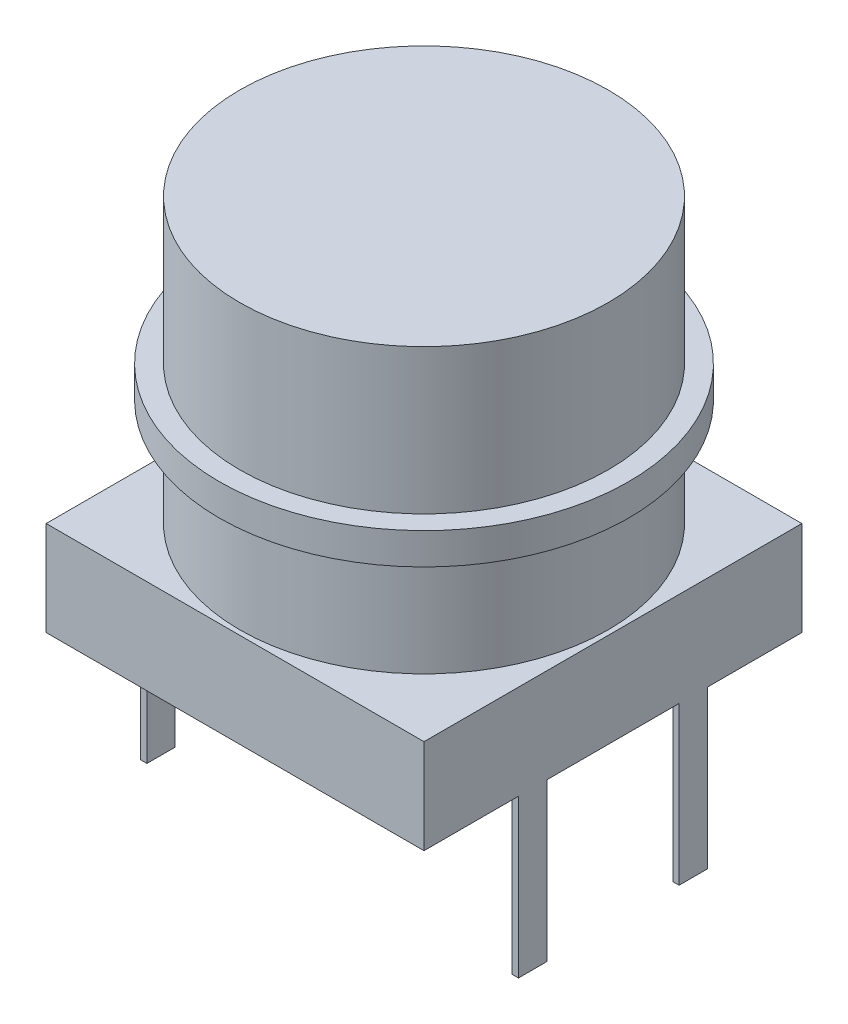
ISO-10303-21;
HEADER;
FILE_DESCRIPTION(('STEP AP214'),'2;1');
FILE_NAME('part.step','',(''),(''),'','','');
FILE_SCHEMA(('AUTOMOTIVE_DESIGN { 1 0 10303 214 1 1 1 1 }'));
ENDSEC;
DATA;
#1=APPLICATION_CONTEXT('core data for automotive mechanical design processes');
#2=APPLICATION_PROTOCOL_DEFINITION('international standard','automotive_design',2000,#1);
#3=PRODUCT_CONTEXT('',#1,'mechanical');
#4=PRODUCT('Part','Part','',(#3));
#5=PRODUCT_RELATED_PRODUCT_CATEGORY('part','',(#4));
#6=PRODUCT_DEFINITION_FORMATION('','',#4);
#7=PRODUCT_DEFINITION_CONTEXT('part definition',#1,'design');
#8=PRODUCT_DEFINITION('design','',#6,#7);
#9=PRODUCT_DEFINITION_SHAPE('','',#8);
#10=(LENGTH_UNIT() NAMED_UNIT(*) SI_UNIT(.MILLI.,.METRE.));
#11=(NAMED_UNIT(*) PLANE_ANGLE_UNIT() SI_UNIT($,.RADIAN.));
#12=(NAMED_UNIT(*) SI_UNIT($,.STERADIAN.) SOLID_ANGLE_UNIT());
#13=UNCERTAINTY_MEASURE_WITH_UNIT(LENGTH_MEASURE(1.E-05),#10,'distance_accuracy_value','');
#14=(GEOMETRIC_REPRESENTATION_CONTEXT(3) GLOBAL_UNCERTAINTY_ASSIGNED_CONTEXT((#13)) GLOBAL_UNIT_ASSIGNED_CONTEXT((#10,
#11,#12)) REPRESENTATION_CONTEXT('',''));
#15=CARTESIAN_POINT('',(0.,0.,0.));
#16=DIRECTION('',(0.,0.,1.));
#17=DIRECTION('',(1.,0.,0.));
#18=AXIS2_PLACEMENT_3D('',#15,#16,#17);
#19=CARTESIAN_POINT('',(0.,0.,0.));
#20=DIRECTION('',(0.,1.,0.));
#21=DIRECTION('',(0.,0.,1.));
#22=AXIS2_PLACEMENT_3D('',#19,#20,#21);
#23=PLANE('',#22);
#24=DIRECTION('',(-1.,0.,0.));
#25=VECTOR('',#24,1.);
#26=CARTESIAN_POINT('',(-5.8,0.,3.));
#27=LINE('',#26,#25);
#28=CARTESIAN_POINT('',(-5.8,0.,3.));
#29=VERTEX_POINT('',#28);
#30=CARTESIAN_POINT('',(-6.,0.,3.));
#31=VERTEX_POINT('',#30);
#32=EDGE_CURVE('E50',#29,#31,#27,.T.);
#33=ORIENTED_EDGE('',*,*,#32,.F.);
#34=DIRECTION('',(0.,0.,1.));
#35=VECTOR('',#34,1.);
#36=CARTESIAN_POINT('',(-5.8,0.,3.));
#37=LINE('',#36,#35);
#38=CARTESIAN_POINT('',(-5.8,0.,2.1));
#39=VERTEX_POINT('',#38);
#40=EDGE_CURVE('E193',#39,#29,#37,.T.);
#41=ORIENTED_EDGE('',*,*,#40,.F.);
#42=DIRECTION('',(1.,0.,0.));
#43=VECTOR('',#42,1.);
#44=CARTESIAN_POINT('',(-5.8,0.,2.1));
#45=LINE('',#44,#43);
#46=CARTESIAN_POINT('',(-6.,0.,2.1));
#47=VERTEX_POINT('',#46);
#48=EDGE_CURVE('E595',#47,#39,#45,.T.);
#49=ORIENTED_EDGE('',*,*,#48,.F.);
#50=DIRECTION('',(0.,0.,1.));
#51=VECTOR('',#50,1.);
#52=CARTESIAN_POINT('',(-6.,0.,-6.));
#53=LINE('',#52,#51);
#54=CARTESIAN_POINT('',(-6.,0.,-2.1));
#55=VERTEX_POINT('',#54);
#56=EDGE_CURVE('E313',#55,#47,#53,.T.);
#57=ORIENTED_EDGE('',*,*,#56,.F.);
#58=DIRECTION('',(-1.,0.,0.));
#59=VECTOR('',#58,1.);
#60=CARTESIAN_POINT('',(-5.8,0.,-2.1));
#61=LINE('',#60,#59);
#62=CARTESIAN_POINT('',(-5.8,0.,-2.1));
#63=VERTEX_POINT('',#62);
#64=EDGE_CURVE('E238',#63,#55,#61,.T.);
#65=ORIENTED_EDGE('',*,*,#64,.F.);
#66=DIRECTION('',(0.,0.,1.));
#67=VECTOR('',#66,1.);
#68=CARTESIAN_POINT('',(-5.8,0.,-3.));
#69=LINE('',#68,#67);
#70=CARTESIAN_POINT('',(-5.8,0.,-3.));
#71=VERTEX_POINT('',#70);
#72=EDGE_CURVE('E224',#71,#63,#69,.T.);
#73=ORIENTED_EDGE('',*,*,#72,.F.);
#74=DIRECTION('',(1.,0.,0.));
#75=VECTOR('',#74,1.);
#76=CARTESIAN_POINT('',(-5.8,0.,-3.));
#77=LINE('',#76,#75);
#78=CARTESIAN_POINT('',(-6.,0.,-3.));
#79=VERTEX_POINT('',#78);
#80=EDGE_CURVE('E229',#79,#71,#77,.T.);
#81=ORIENTED_EDGE('',*,*,#80,.F.);
#82=CARTESIAN_POINT('',(-6.,0.,-6.));
#83=VERTEX_POINT('',#82);
#84=EDGE_CURVE('E311',#83,#79,#53,.T.);
#85=ORIENTED_EDGE('',*,*,#84,.F.);
#86=DIRECTION('',(-1.,0.,0.));
#87=VECTOR('',#86,1.);
#88=CARTESIAN_POINT('',(-6.,0.,-6.));
#89=LINE('',#88,#87);
#90=CARTESIAN_POINT('',(6.,0.,-6.));
#91=VERTEX_POINT('',#90);
#92=EDGE_CURVE('E307',#91,#83,#89,.T.);
#93=ORIENTED_EDGE('',*,*,#92,.F.);
#94=DIRECTION('',(0.,0.,-1.));
#95=VECTOR('',#94,1.);
#96=CARTESIAN_POINT('',(6.,0.,-6.));
#97=LINE('',#96,#95);
#98=CARTESIAN_POINT('',(6.,0.,-3.));
#99=VERTEX_POINT('',#98);
#100=EDGE_CURVE('E290',#99,#91,#97,.T.);
#101=ORIENTED_EDGE('',*,*,#100,.F.);
#102=DIRECTION('',(1.,0.,0.));
#103=VECTOR('',#102,1.);
#104=CARTESIAN_POINT('',(5.8,0.,-3.));
#105=LINE('',#104,#103);
#106=CARTESIAN_POINT('',(5.8,0.,-3.));
#107=VERTEX_POINT('',#106);
#108=EDGE_CURVE('E58',#107,#99,#105,.T.);
#109=ORIENTED_EDGE('',*,*,#108,.F.);
#110=DIRECTION('',(0.,0.,-1.));
#111=VECTOR('',#110,1.);
#112=CARTESIAN_POINT('',(5.8,0.,-3.));
#113=LINE('',#112,#111);
#114=CARTESIAN_POINT('',(5.8,0.,-2.1));
#115=VERTEX_POINT('',#114);
#116=EDGE_CURVE('E207',#115,#107,#113,.T.);
#117=ORIENTED_EDGE('',*,*,#116,.F.);
#118=DIRECTION('',(-1.,0.,0.));
#119=VECTOR('',#118,1.);
#120=CARTESIAN_POINT('',(5.8,0.,-2.1));
#121=LINE('',#120,#119);
#122=CARTESIAN_POINT('',(6.,0.,-2.1));
#123=VERTEX_POINT('',#122);
#124=EDGE_CURVE('E197',#123,#115,#121,.T.);
#125=ORIENTED_EDGE('',*,*,#124,.F.);
#126=CARTESIAN_POINT('',(6.,0.,2.1));
#127=VERTEX_POINT('',#126);
#128=EDGE_CURVE('E308',#127,#123,#97,.T.);
#129=ORIENTED_EDGE('',*,*,#128,.F.);
#130=DIRECTION('',(1.,0.,0.));
#131=VECTOR('',#130,1.);
#132=CARTESIAN_POINT('',(5.8,0.,2.1));
#133=LINE('',#132,#131);
#134=CARTESIAN_POINT('',(5.8,0.,2.1));
#135=VERTEX_POINT('',#134);
#136=EDGE_CURVE('E264',#135,#127,#133,.T.);
#137=ORIENTED_EDGE('',*,*,#136,.F.);
#138=DIRECTION('',(0.,0.,-1.));
#139=VECTOR('',#138,1.);
#140=CARTESIAN_POINT('',(5.8,0.,3.));
#141=LINE('',#140,#139);
#142=CARTESIAN_POINT('',(5.8,0.,3.));
#143=VERTEX_POINT('',#142);
#144=EDGE_CURVE('E250',#143,#135,#141,.T.);
#145=ORIENTED_EDGE('',*,*,#144,.F.);
#146=DIRECTION('',(-1.,0.,0.));
#147=VECTOR('',#146,1.);
#148=CARTESIAN_POINT('',(5.8,0.,3.));
#149=LINE('',#148,#147);
#150=CARTESIAN_POINT('',(6.,0.,3.));
#151=VERTEX_POINT('',#150);
#152=EDGE_CURVE('E255',#151,#143,#149,.T.);
#153=ORIENTED_EDGE('',*,*,#152,.F.);
#154=CARTESIAN_POINT('',(6.,0.,6.));
#155=VERTEX_POINT('',#154);
#156=EDGE_CURVE('E304',#155,#151,#97,.T.);
#157=ORIENTED_EDGE('',*,*,#156,.F.);
#158=DIRECTION('',(1.,0.,0.));
#159=VECTOR('',#158,1.);
#160=CARTESIAN_POINT('',(-6.,0.,6.));
#161=LINE('',#160,#159);
#162=CARTESIAN_POINT('',(-6.,0.,6.));
#163=VERTEX_POINT('',#162);
#164=EDGE_CURVE('E297',#163,#155,#161,.T.);
#165=ORIENTED_EDGE('',*,*,#164,.F.);
#166=EDGE_CURVE('E310',#31,#163,#53,.T.);
#167=ORIENTED_EDGE('',*,*,#166,.F.);
#168=EDGE_LOOP('',(#33,#41,#49,#57,#65,#73,#81,#85,#93,#101,#109,#117,#125,#129,#137,#145,#153,
#157,#165,#167));
#169=FACE_BOUND('',#168,.T.);
#170=ADVANCED_FACE('F33',(#169),#23,.F.);
#171=CARTESIAN_POINT('',(6.,3.,-6.));
#172=DIRECTION('',(-1.,0.,0.));
#173=DIRECTION('',(0.,0.,1.));
#174=AXIS2_PLACEMENT_3D('',#171,#172,#173);
#175=PLANE('',#174);
#176=ORIENTED_EDGE('',*,*,#156,.T.);
#177=DIRECTION('',(0.,1.,0.));
#178=VECTOR('',#177,1.);
#179=CARTESIAN_POINT('',(6.,-5.,3.));
#180=LINE('',#179,#178);
#181=CARTESIAN_POINT('',(6.,-5.,3.));
#182=VERTEX_POINT('',#181);
#183=EDGE_CURVE('E271',#182,#151,#180,.T.);
#184=ORIENTED_EDGE('',*,*,#183,.F.);
#185=DIRECTION('',(0.,0.,1.));
#186=VECTOR('',#185,1.);
#187=CARTESIAN_POINT('',(6.,-5.,3.));
#188=LINE('',#187,#186);
#189=CARTESIAN_POINT('',(6.,-5.,2.1));
#190=VERTEX_POINT('',#189);
#191=EDGE_CURVE('E257',#190,#182,#188,.T.);
#192=ORIENTED_EDGE('',*,*,#191,.F.);
#193=DIRECTION('',(0.,1.,0.));
#194=VECTOR('',#193,1.);
#195=CARTESIAN_POINT('',(6.,-5.,2.1));
#196=LINE('',#195,#194);
#197=EDGE_CURVE('E274',#190,#127,#196,.T.);
#198=ORIENTED_EDGE('',*,*,#197,.T.);
#199=ORIENTED_EDGE('',*,*,#128,.T.);
#200=DIRECTION('',(0.,1.,0.));
#201=VECTOR('',#200,1.);
#202=CARTESIAN_POINT('',(6.,-5.,-2.1));
#203=LINE('',#202,#201);
#204=CARTESIAN_POINT('',(6.,-5.,-2.1));
#205=VERTEX_POINT('',#204);
#206=EDGE_CURVE('E220',#205,#123,#203,.T.);
#207=ORIENTED_EDGE('',*,*,#206,.F.);
#208=DIRECTION('',(0.,0.,1.));
#209=VECTOR('',#208,1.);
#210=CARTESIAN_POINT('',(6.,-5.,-3.));
#211=LINE('',#210,#209);
#212=CARTESIAN_POINT('',(6.,-5.,-3.));
#213=VERTEX_POINT('',#212);
#214=EDGE_CURVE('E206',#213,#205,#211,.T.);
#215=ORIENTED_EDGE('',*,*,#214,.F.);
#216=DIRECTION('',(0.,1.,0.));
#217=VECTOR('',#216,1.);
#218=CARTESIAN_POINT('',(6.,-5.,-3.));
#219=LINE('',#218,#217);
#220=EDGE_CURVE('E222',#213,#99,#219,.T.);
#221=ORIENTED_EDGE('',*,*,#220,.T.);
#222=ORIENTED_EDGE('',*,*,#100,.T.);
#223=DIRECTION('',(0.,-1.,0.));
#224=VECTOR('',#223,1.);
#225=CARTESIAN_POINT('',(6.,3.,-6.));
#226=LINE('',#225,#224);
#227=CARTESIAN_POINT('',(6.,3.,-6.));
#228=VERTEX_POINT('',#227);
#229=EDGE_CURVE('E42',#228,#91,#226,.T.);
#230=ORIENTED_EDGE('',*,*,#229,.F.);
#231=DIRECTION('',(0.,0.,-1.));
#232=VECTOR('',#231,1.);
#233=CARTESIAN_POINT('',(6.,3.,-6.));
#234=LINE('',#233,#232);
#235=CARTESIAN_POINT('',(6.,3.,6.));
#236=VERTEX_POINT('',#235);
#237=EDGE_CURVE('E293',#236,#228,#234,.T.);
#238=ORIENTED_EDGE('',*,*,#237,.F.);
#239=DIRECTION('',(0.,-1.,0.));
#240=VECTOR('',#239,1.);
#241=CARTESIAN_POINT('',(6.,3.,6.));
#242=LINE('',#241,#240);
#243=EDGE_CURVE('E303',#236,#155,#242,.T.);
#244=ORIENTED_EDGE('',*,*,#243,.T.);
#245=EDGE_LOOP('',(#176,#184,#192,#198,#199,#207,#215,#221,#222,#230,#238,#244));
#246=FACE_BOUND('',#245,.T.);
#247=ADVANCED_FACE('F35',(#246),#175,.F.);
#248=CARTESIAN_POINT('',(-6.,3.,-6.));
#249=DIRECTION('',(0.,0.,1.));
#250=DIRECTION('',(1.,0.,0.));
#251=AXIS2_PLACEMENT_3D('',#248,#249,#250);
#252=PLANE('',#251);
#253=ORIENTED_EDGE('',*,*,#92,.T.);
#254=DIRECTION('',(0.,-1.,0.));
#255=VECTOR('',#254,1.);
#256=CARTESIAN_POINT('',(-6.,3.,-6.));
#257=LINE('',#256,#255);
#258=CARTESIAN_POINT('',(-6.,3.,-6.));
#259=VERTEX_POINT('',#258);
#260=EDGE_CURVE('E320',#259,#83,#257,.T.);
#261=ORIENTED_EDGE('',*,*,#260,.F.);
#262=DIRECTION('',(-1.,0.,0.));
#263=VECTOR('',#262,1.);
#264=CARTESIAN_POINT('',(-6.,3.,-6.));
#265=LINE('',#264,#263);
#266=EDGE_CURVE('E296',#228,#259,#265,.T.);
#267=ORIENTED_EDGE('',*,*,#266,.F.);
#268=ORIENTED_EDGE('',*,*,#229,.T.);
#269=EDGE_LOOP('',(#253,#261,#267,#268));
#270=FACE_BOUND('',#269,.T.);
#271=ADVANCED_FACE('F325',(#270),#252,.F.);
#272=CARTESIAN_POINT('',(-6.,3.,-6.));
#273=DIRECTION('',(1.,0.,0.));
#274=DIRECTION('',(0.,0.,-1.));
#275=AXIS2_PLACEMENT_3D('',#272,#273,#274);
#276=PLANE('',#275);
#277=ORIENTED_EDGE('',*,*,#84,.T.);
#278=DIRECTION('',(0.,1.,0.));
#279=VECTOR('',#278,1.);
#280=CARTESIAN_POINT('',(-6.,-5.,-3.));
#281=LINE('',#280,#279);
#282=CARTESIAN_POINT('',(-6.,-5.,-3.));
#283=VERTEX_POINT('',#282);
#284=EDGE_CURVE('E244',#283,#79,#281,.T.);
#285=ORIENTED_EDGE('',*,*,#284,.F.);
#286=DIRECTION('',(0.,0.,-1.));
#287=VECTOR('',#286,1.);
#288=CARTESIAN_POINT('',(-6.,-5.,-3.));
#289=LINE('',#288,#287);
#290=CARTESIAN_POINT('',(-6.,-5.,-2.1));
#291=VERTEX_POINT('',#290);
#292=EDGE_CURVE('E231',#291,#283,#289,.T.);
#293=ORIENTED_EDGE('',*,*,#292,.F.);
#294=DIRECTION('',(0.,1.,0.));
#295=VECTOR('',#294,1.);
#296=CARTESIAN_POINT('',(-6.,-5.,-2.1));
#297=LINE('',#296,#295);
#298=EDGE_CURVE('E246',#291,#55,#297,.T.);
#299=ORIENTED_EDGE('',*,*,#298,.T.);
#300=ORIENTED_EDGE('',*,*,#56,.T.);
#301=DIRECTION('',(0.,1.,0.));
#302=VECTOR('',#301,1.);
#303=CARTESIAN_POINT('',(-6.,-5.,2.1));
#304=LINE('',#303,#302);
#305=CARTESIAN_POINT('',(-6.,-5.,2.1));
#306=VERTEX_POINT('',#305);
#307=EDGE_CURVE('E182',#306,#47,#304,.T.);
#308=ORIENTED_EDGE('',*,*,#307,.F.);
#309=DIRECTION('',(0.,0.,-1.));
#310=VECTOR('',#309,1.);
#311=CARTESIAN_POINT('',(-6.,-5.,3.));
#312=LINE('',#311,#310);
#313=CARTESIAN_POINT('',(-6.,-5.,3.));
#314=VERTEX_POINT('',#313);
#315=EDGE_CURVE('E175',#314,#306,#312,.T.);
#316=ORIENTED_EDGE('',*,*,#315,.F.);
#317=DIRECTION('',(0.,1.,0.));
#318=VECTOR('',#317,1.);
#319=CARTESIAN_POINT('',(-6.,-5.,3.));
#320=LINE('',#319,#318);
#321=EDGE_CURVE('E179',#314,#31,#320,.T.);
#322=ORIENTED_EDGE('',*,*,#321,.T.);
#323=ORIENTED_EDGE('',*,*,#166,.T.);
#324=DIRECTION('',(0.,-1.,0.));
#325=VECTOR('',#324,1.);
#326=CARTESIAN_POINT('',(-6.,3.,6.));
#327=LINE('',#326,#325);
#328=CARTESIAN_POINT('',(-6.,3.,6.));
#329=VERTEX_POINT('',#328);
#330=EDGE_CURVE('E317',#329,#163,#327,.T.);
#331=ORIENTED_EDGE('',*,*,#330,.F.);
#332=DIRECTION('',(0.,0.,1.));
#333=VECTOR('',#332,1.);
#334=CARTESIAN_POINT('',(-6.,3.,-6.));
#335=LINE('',#334,#333);
#336=EDGE_CURVE('E299',#259,#329,#335,.T.);
#337=ORIENTED_EDGE('',*,*,#336,.F.);
#338=ORIENTED_EDGE('',*,*,#260,.T.);
#339=EDGE_LOOP('',(#277,#285,#293,#299,#300,#308,#316,#322,#323,#331,#337,#338));
#340=FACE_BOUND('',#339,.T.);
#341=ADVANCED_FACE('F178',(#340),#276,.F.);
#342=CARTESIAN_POINT('',(-6.,3.,6.));
#343=DIRECTION('',(0.,0.,-1.));
#344=DIRECTION('',(-1.,0.,0.));
#345=AXIS2_PLACEMENT_3D('',#342,#343,#344);
#346=PLANE('',#345);
#347=ORIENTED_EDGE('',*,*,#164,.T.);
#348=ORIENTED_EDGE('',*,*,#243,.F.);
#349=DIRECTION('',(1.,0.,0.));
#350=VECTOR('',#349,1.);
#351=CARTESIAN_POINT('',(-6.,3.,6.));
#352=LINE('',#351,#350);
#353=EDGE_CURVE('E301',#329,#236,#352,.T.);
#354=ORIENTED_EDGE('',*,*,#353,.F.);
#355=ORIENTED_EDGE('',*,*,#330,.T.);
#356=EDGE_LOOP('',(#347,#348,#354,#355));
#357=FACE_BOUND('',#356,.T.);
#358=ADVANCED_FACE('F345',(#357),#346,.F.);
#359=CARTESIAN_POINT('',(0.,3.,0.));
#360=DIRECTION('',(0.,1.,0.));
#361=DIRECTION('',(0.,0.,1.));
#362=AXIS2_PLACEMENT_3D('',#359,#360,#361);
#363=PLANE('',#362);
#364=CARTESIAN_POINT('',(0.,3.,0.));
#365=DIRECTION('',(0.,1.,0.));
#366=DIRECTION('',(0.,0.,1.));
#367=AXIS2_PLACEMENT_3D('',#364,#365,#366);
#368=CIRCLE('',#367,5.85);
#369=CARTESIAN_POINT('',(0.,3.,5.85));
#370=VERTEX_POINT('',#369);
#371=EDGE_CURVE('E283',#370,#370,#368,.F.);
#372=ORIENTED_EDGE('',*,*,#371,.T.);
#373=EDGE_LOOP('',(#372));
#374=FACE_BOUND('',#373,.T.);
#375=ORIENTED_EDGE('',*,*,#237,.T.);
#376=ORIENTED_EDGE('',*,*,#266,.T.);
#377=ORIENTED_EDGE('',*,*,#336,.T.);
#378=ORIENTED_EDGE('',*,*,#353,.T.);
#379=EDGE_LOOP('',(#375,#376,#377,#378));
#380=FACE_BOUND('',#379,.T.);
#381=ADVANCED_FACE('F342',(#374,#380),#363,.T.);
#382=CARTESIAN_POINT('',(0.,12.,0.));
#383=DIRECTION('',(0.,-1.,0.));
#384=DIRECTION('',(0.,0.,-1.));
#385=AXIS2_PLACEMENT_3D('',#382,#383,#384);
#386=CYLINDRICAL_SURFACE('',#385,5.85);
#387=ORIENTED_EDGE('',*,*,#371,.F.);
#388=EDGE_LOOP('',(#387));
#389=FACE_BOUND('',#388,.T.);
#390=CARTESIAN_POINT('',(0.,6.4,0.));
#391=DIRECTION('',(0.,1.,0.));
#392=DIRECTION('',(0.,0.,1.));
#393=AXIS2_PLACEMENT_3D('',#390,#391,#392);
#394=CIRCLE('',#393,5.85);
#395=CARTESIAN_POINT('',(0.,6.4,5.85));
#396=VERTEX_POINT('',#395);
#397=EDGE_CURVE('E11',#396,#396,#394,.F.);
#398=ORIENTED_EDGE('',*,*,#397,.T.);
#399=EDGE_LOOP('',(#398));
#400=FACE_BOUND('',#399,.T.);
#401=ADVANCED_FACE('F417',(#389,#400),#386,.T.);
#402=CARTESIAN_POINT('',(0.,6.4,0.));
#403=DIRECTION('',(0.,1.,0.));
#404=DIRECTION('',(0.,0.,1.));
#405=AXIS2_PLACEMENT_3D('',#402,#403,#404);
#406=PLANE('',#405);
#407=ORIENTED_EDGE('',*,*,#397,.F.);
#408=EDGE_LOOP('',(#407));
#409=FACE_BOUND('',#408,.T.);
#410=CARTESIAN_POINT('',(0.,6.4,0.));
#411=DIRECTION('',(0.,1.,0.));
#412=DIRECTION('',(0.,0.,1.));
#413=AXIS2_PLACEMENT_3D('',#410,#411,#412);
#414=CIRCLE('',#413,6.5);
#415=CARTESIAN_POINT('',(0.,6.4,6.5));
#416=VERTEX_POINT('',#415);
#417=EDGE_CURVE('E286',#416,#416,#414,.T.);
#418=ORIENTED_EDGE('',*,*,#417,.F.);
#419=EDGE_LOOP('',(#418));
#420=FACE_BOUND('',#419,.T.);
#421=ADVANCED_FACE('F424',(#409,#420),#406,.F.);
#422=CARTESIAN_POINT('',(0.,7.4,0.));
#423=DIRECTION('',(0.,-1.,0.));
#424=DIRECTION('',(0.,0.,-1.));
#425=AXIS2_PLACEMENT_3D('',#422,#423,#424);
#426=CYLINDRICAL_SURFACE('',#425,6.5);
#427=CARTESIAN_POINT('',(0.,7.4,0.));
#428=DIRECTION('',(0.,1.,0.));
#429=DIRECTION('',(0.,0.,1.));
#430=AXIS2_PLACEMENT_3D('',#427,#428,#429);
#431=CIRCLE('',#430,6.5);
#432=CARTESIAN_POINT('',(0.,7.4,6.5));
#433=VERTEX_POINT('',#432);
#434=EDGE_CURVE('E287',#433,#433,#431,.T.);
#435=ORIENTED_EDGE('',*,*,#434,.F.);
#436=EDGE_LOOP('',(#435));
#437=FACE_BOUND('',#436,.T.);
#438=ORIENTED_EDGE('',*,*,#417,.T.);
#439=EDGE_LOOP('',(#438));
#440=FACE_BOUND('',#439,.T.);
#441=ADVANCED_FACE('F433',(#437,#440),#426,.T.);
#442=CARTESIAN_POINT('',(0.,7.4,0.));
#443=DIRECTION('',(0.,1.,0.));
#444=DIRECTION('',(0.,0.,1.));
#445=AXIS2_PLACEMENT_3D('',#442,#443,#444);
#446=PLANE('',#445);
#447=CARTESIAN_POINT('',(0.,7.4,0.));
#448=DIRECTION('',(0.,1.,0.));
#449=DIRECTION('',(0.,0.,1.));
#450=AXIS2_PLACEMENT_3D('',#447,#448,#449);
#451=CIRCLE('',#450,5.85);
#452=CARTESIAN_POINT('',(0.,7.4,5.85));
#453=VERTEX_POINT('',#452);
#454=EDGE_CURVE('E37',#453,#453,#451,.F.);
#455=ORIENTED_EDGE('',*,*,#454,.T.);
#456=EDGE_LOOP('',(#455));
#457=FACE_BOUND('',#456,.T.);
#458=ORIENTED_EDGE('',*,*,#434,.T.);
#459=EDGE_LOOP('',(#458));
#460=FACE_BOUND('',#459,.T.);
#461=ADVANCED_FACE('F441',(#457,#460),#446,.T.);
#462=CARTESIAN_POINT('',(0.,12.,0.));
#463=DIRECTION('',(0.,1.,0.));
#464=DIRECTION('',(0.,0.,1.));
#465=AXIS2_PLACEMENT_3D('',#462,#463,#464);
#466=PLANE('',#465);
#467=CARTESIAN_POINT('',(0.,12.,0.));
#468=DIRECTION('',(0.,1.,0.));
#469=DIRECTION('',(0.,0.,1.));
#470=AXIS2_PLACEMENT_3D('',#467,#468,#469);
#471=CIRCLE('',#470,5.85);
#472=CARTESIAN_POINT('',(0.,12.,5.85));
#473=VERTEX_POINT('',#472);
#474=EDGE_CURVE('E280',#473,#473,#471,.T.);
#475=ORIENTED_EDGE('',*,*,#474,.T.);
#476=EDGE_LOOP('',(#475));
#477=FACE_BOUND('',#476,.T.);
#478=ADVANCED_FACE('F447',(#477),#466,.T.);
#479=ORIENTED_EDGE('',*,*,#454,.F.);
#480=EDGE_LOOP('',(#479));
#481=FACE_BOUND('',#480,.T.);
#482=ORIENTED_EDGE('',*,*,#474,.F.);
#483=EDGE_LOOP('',(#482));
#484=FACE_BOUND('',#483,.T.);
#485=ADVANCED_FACE('F427',(#481,#484),#386,.T.);
#486=CARTESIAN_POINT('',(5.8,-5.,3.));
#487=DIRECTION('',(1.,0.,0.));
#488=DIRECTION('',(0.,0.,-1.));
#489=AXIS2_PLACEMENT_3D('',#486,#487,#488);
#490=PLANE('',#489);
#491=ORIENTED_EDGE('',*,*,#144,.T.);
#492=DIRECTION('',(0.,1.,0.));
#493=VECTOR('',#492,1.);
#494=CARTESIAN_POINT('',(5.8,-5.,2.1));
#495=LINE('',#494,#493);
#496=CARTESIAN_POINT('',(5.8,-5.,2.1));
#497=VERTEX_POINT('',#496);
#498=EDGE_CURVE('E277',#497,#135,#495,.T.);
#499=ORIENTED_EDGE('',*,*,#498,.F.);
#500=DIRECTION('',(0.,0.,-1.));
#501=VECTOR('',#500,1.);
#502=CARTESIAN_POINT('',(5.8,-5.,3.));
#503=LINE('',#502,#501);
#504=CARTESIAN_POINT('',(5.8,-5.,3.));
#505=VERTEX_POINT('',#504);
#506=EDGE_CURVE('E251',#505,#497,#503,.T.);
#507=ORIENTED_EDGE('',*,*,#506,.F.);
#508=DIRECTION('',(0.,1.,0.));
#509=VECTOR('',#508,1.);
#510=CARTESIAN_POINT('',(5.8,-5.,3.));
#511=LINE('',#510,#509);
#512=EDGE_CURVE('E261',#505,#143,#511,.T.);
#513=ORIENTED_EDGE('',*,*,#512,.T.);
#514=EDGE_LOOP('',(#491,#499,#507,#513));
#515=FACE_BOUND('',#514,.T.);
#516=ADVANCED_FACE('F355',(#515),#490,.F.);
#517=CARTESIAN_POINT('',(5.8,-5.,2.1));
#518=DIRECTION('',(0.,0.,1.));
#519=DIRECTION('',(1.,0.,0.));
#520=AXIS2_PLACEMENT_3D('',#517,#518,#519);
#521=PLANE('',#520);
#522=ORIENTED_EDGE('',*,*,#136,.T.);
#523=ORIENTED_EDGE('',*,*,#197,.F.);
#524=DIRECTION('',(1.,0.,0.));
#525=VECTOR('',#524,1.);
#526=CARTESIAN_POINT('',(5.8,-5.,2.1));
#527=LINE('',#526,#525);
#528=EDGE_CURVE('E254',#497,#190,#527,.T.);
#529=ORIENTED_EDGE('',*,*,#528,.F.);
#530=ORIENTED_EDGE('',*,*,#498,.T.);
#531=EDGE_LOOP('',(#522,#523,#529,#530));
#532=FACE_BOUND('',#531,.T.);
#533=ADVANCED_FACE('F364',(#532),#521,.F.);
#534=CARTESIAN_POINT('',(5.8,-5.,3.));
#535=DIRECTION('',(0.,0.,-1.));
#536=DIRECTION('',(-1.,0.,0.));
#537=AXIS2_PLACEMENT_3D('',#534,#535,#536);
#538=PLANE('',#537);
#539=ORIENTED_EDGE('',*,*,#152,.T.);
#540=ORIENTED_EDGE('',*,*,#512,.F.);
#541=DIRECTION('',(-1.,0.,0.));
#542=VECTOR('',#541,1.);
#543=CARTESIAN_POINT('',(5.8,-5.,3.));
#544=LINE('',#543,#542);
#545=EDGE_CURVE('E259',#182,#505,#544,.T.);
#546=ORIENTED_EDGE('',*,*,#545,.F.);
#547=ORIENTED_EDGE('',*,*,#183,.T.);
#548=EDGE_LOOP('',(#539,#540,#546,#547));
#549=FACE_BOUND('',#548,.T.);
#550=ADVANCED_FACE('F351',(#549),#538,.F.);
#551=CARTESIAN_POINT('',(0.,-5.,0.));
#552=DIRECTION('',(0.,-1.,0.));
#553=DIRECTION('',(0.,0.,-1.));
#554=AXIS2_PLACEMENT_3D('',#551,#552,#553);
#555=PLANE('',#554);
#556=ORIENTED_EDGE('',*,*,#506,.T.);
#557=ORIENTED_EDGE('',*,*,#528,.T.);
#558=ORIENTED_EDGE('',*,*,#191,.T.);
#559=ORIENTED_EDGE('',*,*,#545,.T.);
#560=EDGE_LOOP('',(#556,#557,#558,#559));
#561=FACE_BOUND('',#560,.T.);
#562=ADVANCED_FACE('F358',(#561),#555,.T.);
#563=CARTESIAN_POINT('',(-5.8,-5.,-3.));
#564=DIRECTION('',(-1.,0.,0.));
#565=DIRECTION('',(0.,0.,1.));
#566=AXIS2_PLACEMENT_3D('',#563,#564,#565);
#567=PLANE('',#566);
#568=ORIENTED_EDGE('',*,*,#72,.T.);
#569=DIRECTION('',(0.,1.,0.));
#570=VECTOR('',#569,1.);
#571=CARTESIAN_POINT('',(-5.8,-5.,-2.1));
#572=LINE('',#571,#570);
#573=CARTESIAN_POINT('',(-5.8,-5.,-2.1));
#574=VERTEX_POINT('',#573);
#575=EDGE_CURVE('E248',#574,#63,#572,.T.);
#576=ORIENTED_EDGE('',*,*,#575,.F.);
#577=DIRECTION('',(0.,0.,1.));
#578=VECTOR('',#577,1.);
#579=CARTESIAN_POINT('',(-5.8,-5.,-3.));
#580=LINE('',#579,#578);
#581=CARTESIAN_POINT('',(-5.8,-5.,-3.));
#582=VERTEX_POINT('',#581);
#583=EDGE_CURVE('E225',#582,#574,#580,.T.);
#584=ORIENTED_EDGE('',*,*,#583,.F.);
#585=DIRECTION('',(0.,1.,0.));
#586=VECTOR('',#585,1.);
#587=CARTESIAN_POINT('',(-5.8,-5.,-3.));
#588=LINE('',#587,#586);
#589=EDGE_CURVE('E235',#582,#71,#588,.T.);
#590=ORIENTED_EDGE('',*,*,#589,.T.);
#591=EDGE_LOOP('',(#568,#576,#584,#590));
#592=FACE_BOUND('',#591,.T.);
#593=ADVANCED_FACE('F497',(#592),#567,.F.);
#594=CARTESIAN_POINT('',(-5.8,-5.,-2.1));
#595=DIRECTION('',(0.,0.,-1.));
#596=DIRECTION('',(-1.,0.,0.));
#597=AXIS2_PLACEMENT_3D('',#594,#595,#596);
#598=PLANE('',#597);
#599=ORIENTED_EDGE('',*,*,#64,.T.);
#600=ORIENTED_EDGE('',*,*,#298,.F.);
#601=DIRECTION('',(-1.,0.,0.));
#602=VECTOR('',#601,1.);
#603=CARTESIAN_POINT('',(-5.8,-5.,-2.1));
#604=LINE('',#603,#602);
#605=EDGE_CURVE('E228',#574,#291,#604,.T.);
#606=ORIENTED_EDGE('',*,*,#605,.F.);
#607=ORIENTED_EDGE('',*,*,#575,.T.);
#608=EDGE_LOOP('',(#599,#600,#606,#607));
#609=FACE_BOUND('',#608,.T.);
#610=ADVANCED_FACE('F504',(#609),#598,.F.);
#611=CARTESIAN_POINT('',(-5.8,-5.,-3.));
#612=DIRECTION('',(0.,0.,1.));
#613=DIRECTION('',(1.,0.,0.));
#614=AXIS2_PLACEMENT_3D('',#611,#612,#613);
#615=PLANE('',#614);
#616=ORIENTED_EDGE('',*,*,#80,.T.);
#617=ORIENTED_EDGE('',*,*,#589,.F.);
#618=DIRECTION('',(1.,0.,0.));
#619=VECTOR('',#618,1.);
#620=CARTESIAN_POINT('',(-5.8,-5.,-3.));
#621=LINE('',#620,#619);
#622=EDGE_CURVE('E233',#283,#582,#621,.T.);
#623=ORIENTED_EDGE('',*,*,#622,.F.);
#624=ORIENTED_EDGE('',*,*,#284,.T.);
#625=EDGE_LOOP('',(#616,#617,#623,#624));
#626=FACE_BOUND('',#625,.T.);
#627=ADVANCED_FACE('F387',(#626),#615,.F.);
#628=CARTESIAN_POINT('',(0.,-5.,0.));
#629=DIRECTION('',(0.,-1.,0.));
#630=DIRECTION('',(0.,0.,-1.));
#631=AXIS2_PLACEMENT_3D('',#628,#629,#630);
#632=PLANE('',#631);
#633=ORIENTED_EDGE('',*,*,#583,.T.);
#634=ORIENTED_EDGE('',*,*,#605,.T.);
#635=ORIENTED_EDGE('',*,*,#292,.T.);
#636=ORIENTED_EDGE('',*,*,#622,.T.);
#637=EDGE_LOOP('',(#633,#634,#635,#636));
#638=FACE_BOUND('',#637,.T.);
#639=ADVANCED_FACE('F380',(#638),#632,.T.);
#640=CARTESIAN_POINT('',(5.8,-5.,-3.));
#641=DIRECTION('',(0.,0.,1.));
#642=DIRECTION('',(1.,0.,0.));
#643=AXIS2_PLACEMENT_3D('',#640,#641,#642);
#644=PLANE('',#643);
#645=ORIENTED_EDGE('',*,*,#108,.T.);
#646=ORIENTED_EDGE('',*,*,#220,.F.);
#647=DIRECTION('',(1.,0.,0.));
#648=VECTOR('',#647,1.);
#649=CARTESIAN_POINT('',(5.8,-5.,-3.));
#650=LINE('',#649,#648);
#651=CARTESIAN_POINT('',(5.8,-5.,-3.));
#652=VERTEX_POINT('',#651);
#653=EDGE_CURVE('E203',#652,#213,#650,.T.);
#654=ORIENTED_EDGE('',*,*,#653,.F.);
#655=DIRECTION('',(0.,1.,0.));
#656=VECTOR('',#655,1.);
#657=CARTESIAN_POINT('',(5.8,-5.,-3.));
#658=LINE('',#657,#656);
#659=EDGE_CURVE('E212',#652,#107,#658,.T.);
#660=ORIENTED_EDGE('',*,*,#659,.T.);
#661=EDGE_LOOP('',(#645,#646,#654,#660));
#662=FACE_BOUND('',#661,.T.);
#663=ADVANCED_FACE('F378',(#662),#644,.F.);
#664=CARTESIAN_POINT('',(5.8,-5.,-2.1));
#665=DIRECTION('',(0.,0.,-1.));
#666=DIRECTION('',(-1.,0.,0.));
#667=AXIS2_PLACEMENT_3D('',#664,#665,#666);
#668=PLANE('',#667);
#669=ORIENTED_EDGE('',*,*,#124,.T.);
#670=DIRECTION('',(0.,1.,0.));
#671=VECTOR('',#670,1.);
#672=CARTESIAN_POINT('',(5.8,-5.,-2.1));
#673=LINE('',#672,#671);
#674=CARTESIAN_POINT('',(5.8,-5.,-2.1));
#675=VERTEX_POINT('',#674);
#676=EDGE_CURVE('E217',#675,#115,#673,.T.);
#677=ORIENTED_EDGE('',*,*,#676,.F.);
#678=DIRECTION('',(-1.,0.,0.));
#679=VECTOR('',#678,1.);
#680=CARTESIAN_POINT('',(5.8,-5.,-2.1));
#681=LINE('',#680,#679);
#682=EDGE_CURVE('E209',#205,#675,#681,.T.);
#683=ORIENTED_EDGE('',*,*,#682,.F.);
#684=ORIENTED_EDGE('',*,*,#206,.T.);
#685=EDGE_LOOP('',(#669,#677,#683,#684));
#686=FACE_BOUND('',#685,.T.);
#687=ADVANCED_FACE('F369',(#686),#668,.F.);
#688=CARTESIAN_POINT('',(5.8,-5.,-3.));
#689=DIRECTION('',(1.,0.,0.));
#690=DIRECTION('',(0.,0.,-1.));
#691=AXIS2_PLACEMENT_3D('',#688,#689,#690);
#692=PLANE('',#691);
#693=ORIENTED_EDGE('',*,*,#116,.T.);
#694=ORIENTED_EDGE('',*,*,#659,.F.);
#695=DIRECTION('',(0.,0.,-1.));
#696=VECTOR('',#695,1.);
#697=CARTESIAN_POINT('',(5.8,-5.,-3.));
#698=LINE('',#697,#696);
#699=EDGE_CURVE('E211',#675,#652,#698,.T.);
#700=ORIENTED_EDGE('',*,*,#699,.F.);
#701=ORIENTED_EDGE('',*,*,#676,.T.);
#702=EDGE_LOOP('',(#693,#694,#700,#701));
#703=FACE_BOUND('',#702,.T.);
#704=ADVANCED_FACE('F373',(#703),#692,.F.);
#705=CARTESIAN_POINT('',(0.,-5.,0.));
#706=DIRECTION('',(0.,-1.,0.));
#707=DIRECTION('',(0.,0.,-1.));
#708=AXIS2_PLACEMENT_3D('',#705,#706,#707);
#709=PLANE('',#708);
#710=ORIENTED_EDGE('',*,*,#653,.T.);
#711=ORIENTED_EDGE('',*,*,#214,.T.);
#712=ORIENTED_EDGE('',*,*,#682,.T.);
#713=ORIENTED_EDGE('',*,*,#699,.T.);
#714=EDGE_LOOP('',(#710,#711,#712,#713));
#715=FACE_BOUND('',#714,.T.);
#716=ADVANCED_FACE('F377',(#715),#709,.T.);
#717=CARTESIAN_POINT('',(-5.8,-5.,3.));
#718=DIRECTION('',(0.,0.,-1.));
#719=DIRECTION('',(-1.,0.,0.));
#720=AXIS2_PLACEMENT_3D('',#717,#718,#719);
#721=PLANE('',#720);
#722=ORIENTED_EDGE('',*,*,#32,.T.);
#723=ORIENTED_EDGE('',*,*,#321,.F.);
#724=DIRECTION('',(-1.,0.,0.));
#725=VECTOR('',#724,1.);
#726=CARTESIAN_POINT('',(-5.8,-5.,3.));
#727=LINE('',#726,#725);
#728=CARTESIAN_POINT('',(-5.8,-5.,3.));
#729=VERTEX_POINT('',#728);
#730=EDGE_CURVE('E186',#729,#314,#727,.T.);
#731=ORIENTED_EDGE('',*,*,#730,.F.);
#732=DIRECTION('',(0.,1.,0.));
#733=VECTOR('',#732,1.);
#734=CARTESIAN_POINT('',(-5.8,-5.,3.));
#735=LINE('',#734,#733);
#736=EDGE_CURVE('E592',#729,#29,#735,.T.);
#737=ORIENTED_EDGE('',*,*,#736,.T.);
#738=EDGE_LOOP('',(#722,#723,#731,#737));
#739=FACE_BOUND('',#738,.T.);
#740=ADVANCED_FACE('F195',(#739),#721,.F.);
#741=CARTESIAN_POINT('',(-5.8,-5.,2.1));
#742=DIRECTION('',(0.,0.,1.));
#743=DIRECTION('',(1.,0.,0.));
#744=AXIS2_PLACEMENT_3D('',#741,#742,#743);
#745=PLANE('',#744);
#746=ORIENTED_EDGE('',*,*,#48,.T.);
#747=DIRECTION('',(0.,1.,0.));
#748=VECTOR('',#747,1.);
#749=CARTESIAN_POINT('',(-5.8,-5.,2.1));
#750=LINE('',#749,#748);
#751=CARTESIAN_POINT('',(-5.8,-5.,2.1));
#752=VERTEX_POINT('',#751);
#753=EDGE_CURVE('E199',#752,#39,#750,.T.);
#754=ORIENTED_EDGE('',*,*,#753,.F.);
#755=DIRECTION('',(1.,0.,0.));
#756=VECTOR('',#755,1.);
#757=CARTESIAN_POINT('',(-5.8,-5.,2.1));
#758=LINE('',#757,#756);
#759=EDGE_CURVE('E185',#306,#752,#758,.T.);
#760=ORIENTED_EDGE('',*,*,#759,.F.);
#761=ORIENTED_EDGE('',*,*,#307,.T.);
#762=EDGE_LOOP('',(#746,#754,#760,#761));
#763=FACE_BOUND('',#762,.T.);
#764=ADVANCED_FACE('F559',(#763),#745,.F.);
#765=CARTESIAN_POINT('',(-5.8,-5.,3.));
#766=DIRECTION('',(-1.,0.,0.));
#767=DIRECTION('',(0.,0.,1.));
#768=AXIS2_PLACEMENT_3D('',#765,#766,#767);
#769=PLANE('',#768);
#770=ORIENTED_EDGE('',*,*,#40,.T.);
#771=ORIENTED_EDGE('',*,*,#736,.F.);
#772=DIRECTION('',(0.,0.,1.));
#773=VECTOR('',#772,1.);
#774=CARTESIAN_POINT('',(-5.8,-5.,3.));
#775=LINE('',#774,#773);
#776=EDGE_CURVE('E191',#752,#729,#775,.T.);
#777=ORIENTED_EDGE('',*,*,#776,.F.);
#778=ORIENTED_EDGE('',*,*,#753,.T.);
#779=EDGE_LOOP('',(#770,#771,#777,#778));
#780=FACE_BOUND('',#779,.T.);
#781=ADVANCED_FACE('F568',(#780),#769,.F.);
#782=CARTESIAN_POINT('',(0.,-5.,0.));
#783=DIRECTION('',(0.,-1.,0.));
#784=DIRECTION('',(0.,0.,-1.));
#785=AXIS2_PLACEMENT_3D('',#782,#783,#784);
#786=PLANE('',#785);
#787=ORIENTED_EDGE('',*,*,#730,.T.);
#788=ORIENTED_EDGE('',*,*,#315,.T.);
#789=ORIENTED_EDGE('',*,*,#759,.T.);
#790=ORIENTED_EDGE('',*,*,#776,.T.);
#791=EDGE_LOOP('',(#787,#788,#789,#790));
#792=FACE_BOUND('',#791,.T.);
#793=ADVANCED_FACE('F189',(#792),#786,.T.);
#794=CLOSED_SHELL('',(#170,#247,#271,#341,#358,#381,#401,#421,#441,#461,#478,#485,#516,#533,
#550,#562,#593,#610,#627,#639,#663,#687,#704,#716,#740,#764,#781,#793));
#795=MANIFOLD_SOLID_BREP('B2',#794);
#796=ADVANCED_BREP_SHAPE_REPRESENTATION('',(#18,#795),#14);
#797=SHAPE_DEFINITION_REPRESENTATION(#9,#796);
ENDSEC;
END-ISO-10303-21;
